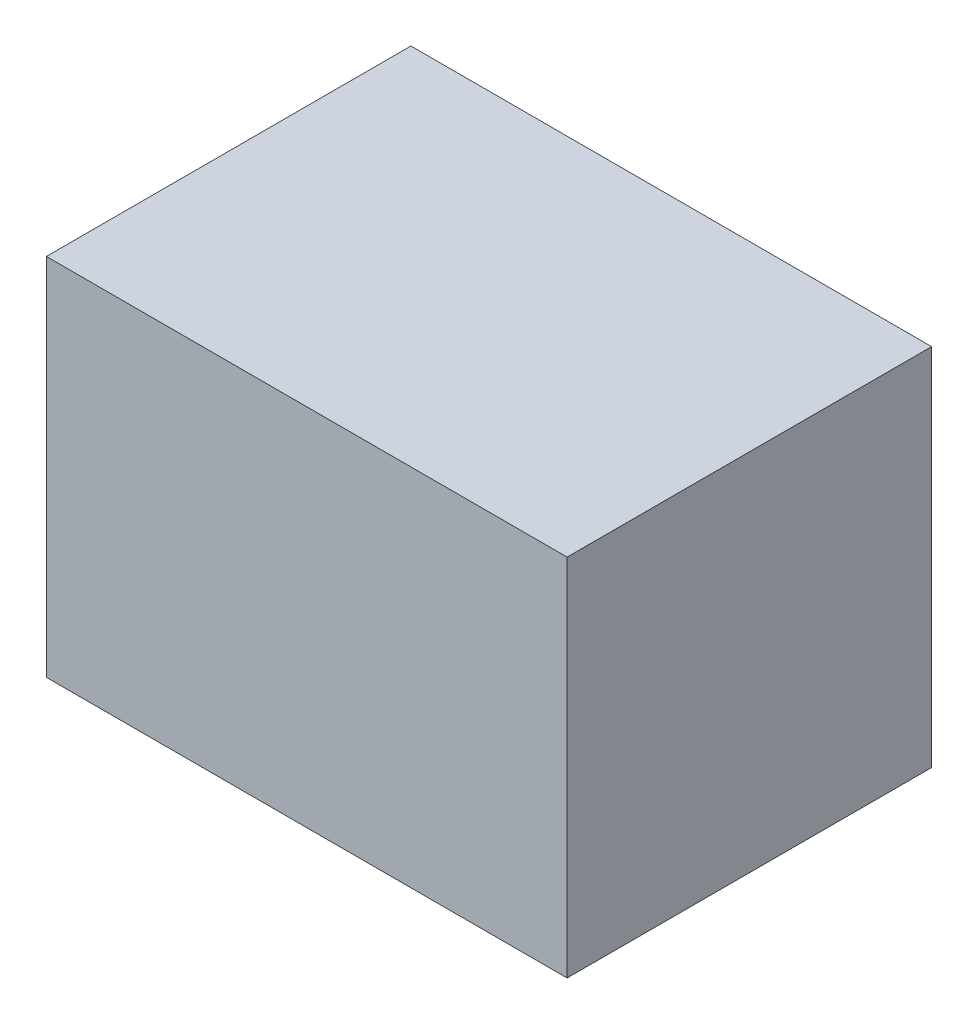
ISO-10303-21;
HEADER;
FILE_DESCRIPTION(('STEP AP214'),'2;1');
FILE_NAME('part.step','',(''),(''),'','','');
FILE_SCHEMA(('AUTOMOTIVE_DESIGN { 1 0 10303 214 1 1 1 1 }'));
ENDSEC;
DATA;
#1=APPLICATION_CONTEXT('core data for automotive mechanical design processes');
#2=APPLICATION_PROTOCOL_DEFINITION('international standard','automotive_design',2000,#1);
#3=PRODUCT_CONTEXT('',#1,'mechanical');
#4=PRODUCT('Part','Part','',(#3));
#5=PRODUCT_RELATED_PRODUCT_CATEGORY('part','',(#4));
#6=PRODUCT_DEFINITION_FORMATION('','',#4);
#7=PRODUCT_DEFINITION_CONTEXT('part definition',#1,'design');
#8=PRODUCT_DEFINITION('design','',#6,#7);
#9=PRODUCT_DEFINITION_SHAPE('','',#8);
#10=(LENGTH_UNIT() NAMED_UNIT(*) SI_UNIT(.MILLI.,.METRE.));
#11=(NAMED_UNIT(*) PLANE_ANGLE_UNIT() SI_UNIT($,.RADIAN.));
#12=(NAMED_UNIT(*) SI_UNIT($,.STERADIAN.) SOLID_ANGLE_UNIT());
#13=UNCERTAINTY_MEASURE_WITH_UNIT(LENGTH_MEASURE(1.E-05),#10,'distance_accuracy_value','');
#14=(GEOMETRIC_REPRESENTATION_CONTEXT(3) GLOBAL_UNCERTAINTY_ASSIGNED_CONTEXT((#13)) GLOBAL_UNIT_ASSIGNED_CONTEXT((#10,
#11,#12)) REPRESENTATION_CONTEXT('',''));
#15=CARTESIAN_POINT('',(0.,0.,0.));
#16=DIRECTION('',(0.,0.,1.));
#17=DIRECTION('',(1.,0.,0.));
#18=AXIS2_PLACEMENT_3D('',#15,#16,#17);
#19=CARTESIAN_POINT('',(-12.7,0.,0.));
#20=DIRECTION('',(0.,-1.,0.));
#21=DIRECTION('',(0.,0.,-1.));
#22=AXIS2_PLACEMENT_3D('',#19,#20,#21);
#23=PLANE('',#22);
#24=DIRECTION('',(1.,0.,0.));
#25=VECTOR('',#24,1.);
#26=CARTESIAN_POINT('',(-12.7,0.,-1.1));
#27=LINE('',#26,#25);
#28=CARTESIAN_POINT('',(2.29,0.,-1.1));
#29=VERTEX_POINT('',#28);
#30=CARTESIAN_POINT('',(2.79,0.,-1.1));
#31=VERTEX_POINT('',#30);
#32=EDGE_CURVE('E108',#29,#31,#27,.T.);
#33=ORIENTED_EDGE('',*,*,#32,.F.);
#34=DIRECTION('',(0.,0.,1.));
#35=VECTOR('',#34,1.);
#36=CARTESIAN_POINT('',(2.29,0.,0.));
#37=LINE('',#36,#35);
#38=CARTESIAN_POINT('',(2.29,0.,-0.75));
#39=VERTEX_POINT('',#38);
#40=EDGE_CURVE('E28',#29,#39,#37,.T.);
#41=ORIENTED_EDGE('',*,*,#40,.T.);
#42=DIRECTION('',(1.,0.,0.));
#43=VECTOR('',#42,1.);
#44=CARTESIAN_POINT('',(-12.7,0.,-0.75));
#45=LINE('',#44,#43);
#46=CARTESIAN_POINT('',(2.79,0.,-0.75));
#47=VERTEX_POINT('',#46);
#48=EDGE_CURVE('E92',#39,#47,#45,.T.);
#49=ORIENTED_EDGE('',*,*,#48,.T.);
#50=DIRECTION('',(0.,0.,1.));
#51=VECTOR('',#50,1.);
#52=CARTESIAN_POINT('',(2.79,0.,0.));
#53=LINE('',#52,#51);
#54=EDGE_CURVE('E21',#31,#47,#53,.T.);
#55=ORIENTED_EDGE('',*,*,#54,.F.);
#56=EDGE_LOOP('',(#33,#41,#49,#55));
#57=FACE_BOUND('',#56,.T.);
#58=ADVANCED_FACE('F17',(#57),#23,.F.);
#59=CARTESIAN_POINT('',(-12.7,-0.35,0.));
#60=DIRECTION('',(0.,-1.,0.));
#61=DIRECTION('',(0.,0.,-1.));
#62=AXIS2_PLACEMENT_3D('',#59,#60,#61);
#63=PLANE('',#62);
#64=DIRECTION('',(1.,0.,0.));
#65=VECTOR('',#64,1.);
#66=CARTESIAN_POINT('',(-12.7,-0.35,-1.1));
#67=LINE('',#66,#65);
#68=CARTESIAN_POINT('',(2.29,-0.35,-1.1));
#69=VERTEX_POINT('',#68);
#70=CARTESIAN_POINT('',(2.79,-0.35,-1.1));
#71=VERTEX_POINT('',#70);
#72=EDGE_CURVE('E89',#69,#71,#67,.T.);
#73=ORIENTED_EDGE('',*,*,#72,.T.);
#74=DIRECTION('',(0.,0.,1.));
#75=VECTOR('',#74,1.);
#76=CARTESIAN_POINT('',(2.79,-0.35,0.));
#77=LINE('',#76,#75);
#78=CARTESIAN_POINT('',(2.79,-0.35,-0.75));
#79=VERTEX_POINT('',#78);
#80=EDGE_CURVE('E69',#71,#79,#77,.T.);
#81=ORIENTED_EDGE('',*,*,#80,.T.);
#82=DIRECTION('',(1.,0.,0.));
#83=VECTOR('',#82,1.);
#84=CARTESIAN_POINT('',(-12.7,-0.35,-0.75));
#85=LINE('',#84,#83);
#86=CARTESIAN_POINT('',(2.29,-0.35,-0.75));
#87=VERTEX_POINT('',#86);
#88=EDGE_CURVE('E79',#87,#79,#85,.T.);
#89=ORIENTED_EDGE('',*,*,#88,.F.);
#90=DIRECTION('',(0.,0.,1.));
#91=VECTOR('',#90,1.);
#92=CARTESIAN_POINT('',(2.29,-0.35,0.));
#93=LINE('',#92,#91);
#94=EDGE_CURVE('E11',#69,#87,#93,.T.);
#95=ORIENTED_EDGE('',*,*,#94,.F.);
#96=EDGE_LOOP('',(#73,#81,#89,#95));
#97=FACE_BOUND('',#96,.T.);
#98=ADVANCED_FACE('F87',(#97),#63,.T.);
#99=CARTESIAN_POINT('',(2.29,-0.35,0.));
#100=DIRECTION('',(-1.,0.,0.));
#101=DIRECTION('',(0.,0.,1.));
#102=AXIS2_PLACEMENT_3D('',#99,#100,#101);
#103=PLANE('',#102);
#104=ORIENTED_EDGE('',*,*,#40,.F.);
#105=DIRECTION('',(0.,1.,0.));
#106=VECTOR('',#105,1.);
#107=CARTESIAN_POINT('',(2.29,-0.35,-1.1));
#108=LINE('',#107,#106);
#109=EDGE_CURVE('E102',#69,#29,#108,.T.);
#110=ORIENTED_EDGE('',*,*,#109,.F.);
#111=ORIENTED_EDGE('',*,*,#94,.T.);
#112=DIRECTION('',(0.,1.,0.));
#113=VECTOR('',#112,1.);
#114=CARTESIAN_POINT('',(2.29,-0.35,-0.75));
#115=LINE('',#114,#113);
#116=EDGE_CURVE('E84',#87,#39,#115,.T.);
#117=ORIENTED_EDGE('',*,*,#116,.T.);
#118=EDGE_LOOP('',(#104,#110,#111,#117));
#119=FACE_BOUND('',#118,.T.);
#120=ADVANCED_FACE('F19',(#119),#103,.T.);
#121=CARTESIAN_POINT('',(-12.7,-0.35,-0.75));
#122=DIRECTION('',(0.,0.,1.));
#123=DIRECTION('',(1.,0.,0.));
#124=AXIS2_PLACEMENT_3D('',#121,#122,#123);
#125=PLANE('',#124);
#126=ORIENTED_EDGE('',*,*,#48,.F.);
#127=ORIENTED_EDGE('',*,*,#116,.F.);
#128=ORIENTED_EDGE('',*,*,#88,.T.);
#129=DIRECTION('',(0.,1.,0.));
#130=VECTOR('',#129,1.);
#131=CARTESIAN_POINT('',(2.79,-0.35,-0.75));
#132=LINE('',#131,#130);
#133=EDGE_CURVE('E82',#79,#47,#132,.T.);
#134=ORIENTED_EDGE('',*,*,#133,.T.);
#135=EDGE_LOOP('',(#126,#127,#128,#134));
#136=FACE_BOUND('',#135,.T.);
#137=ADVANCED_FACE('F81',(#136),#125,.T.);
#138=CARTESIAN_POINT('',(2.79,-0.35,0.));
#139=DIRECTION('',(-1.,0.,0.));
#140=DIRECTION('',(0.,0.,1.));
#141=AXIS2_PLACEMENT_3D('',#138,#139,#140);
#142=PLANE('',#141);
#143=ORIENTED_EDGE('',*,*,#54,.T.);
#144=ORIENTED_EDGE('',*,*,#133,.F.);
#145=ORIENTED_EDGE('',*,*,#80,.F.);
#146=DIRECTION('',(0.,1.,0.));
#147=VECTOR('',#146,1.);
#148=CARTESIAN_POINT('',(2.79,-0.35,-1.1));
#149=LINE('',#148,#147);
#150=EDGE_CURVE('E106',#71,#31,#149,.T.);
#151=ORIENTED_EDGE('',*,*,#150,.T.);
#152=EDGE_LOOP('',(#143,#144,#145,#151));
#153=FACE_BOUND('',#152,.T.);
#154=ADVANCED_FACE('F94',(#153),#142,.F.);
#155=CARTESIAN_POINT('',(-12.7,-0.35,-1.1));
#156=DIRECTION('',(0.,0.,1.));
#157=DIRECTION('',(1.,0.,0.));
#158=AXIS2_PLACEMENT_3D('',#155,#156,#157);
#159=PLANE('',#158);
#160=ORIENTED_EDGE('',*,*,#32,.T.);
#161=ORIENTED_EDGE('',*,*,#150,.F.);
#162=ORIENTED_EDGE('',*,*,#72,.F.);
#163=ORIENTED_EDGE('',*,*,#109,.T.);
#164=EDGE_LOOP('',(#160,#161,#162,#163));
#165=FACE_BOUND('',#164,.T.);
#166=ADVANCED_FACE('F134',(#165),#159,.F.);
#167=CLOSED_SHELL('',(#58,#98,#120,#137,#154,#166));
#168=MANIFOLD_SOLID_BREP('B1',#167);
#169=ADVANCED_BREP_SHAPE_REPRESENTATION('',(#18,#168),#14);
#170=SHAPE_DEFINITION_REPRESENTATION(#9,#169);
ENDSEC;
END-ISO-10303-21;
